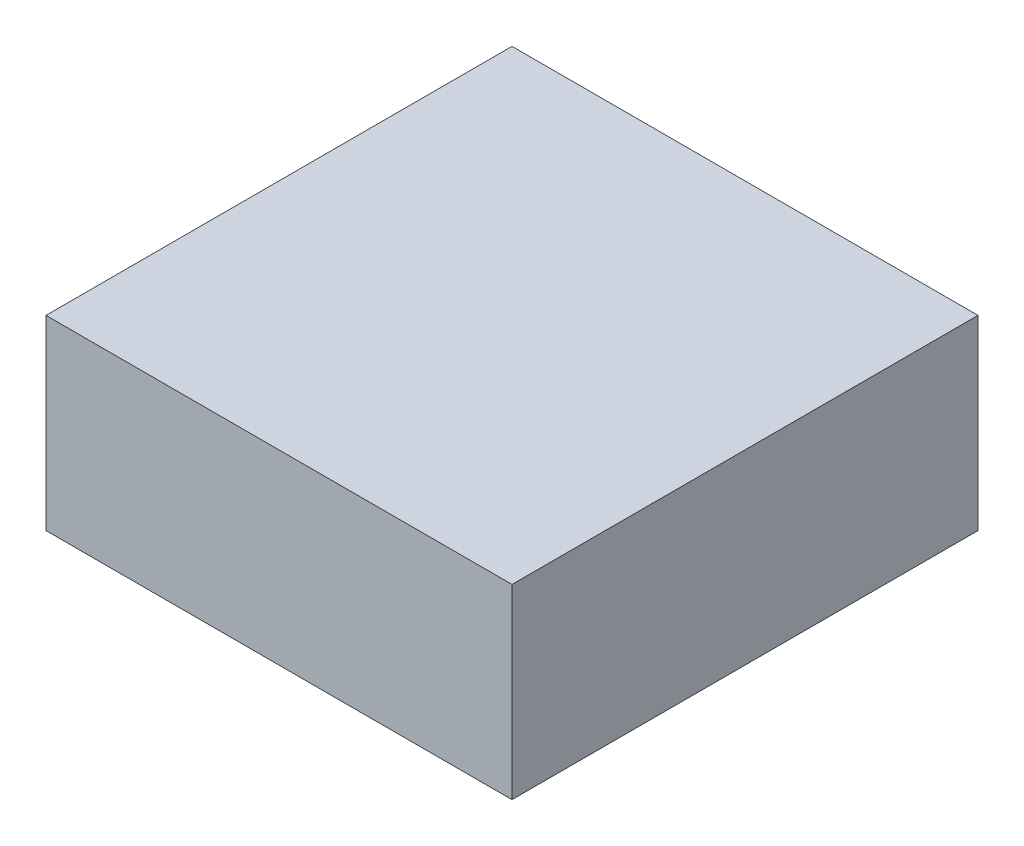
ISO-10303-21;
HEADER;
FILE_DESCRIPTION(('STEP AP214'),'2;1');
FILE_NAME('part.step','',(''),(''),'','','');
FILE_SCHEMA(('AUTOMOTIVE_DESIGN { 1 0 10303 214 1 1 1 1 }'));
ENDSEC;
DATA;
#1=APPLICATION_CONTEXT('core data for automotive mechanical design processes');
#2=APPLICATION_PROTOCOL_DEFINITION('international standard','automotive_design',2000,#1);
#3=PRODUCT_CONTEXT('',#1,'mechanical');
#4=PRODUCT('Part','Part','',(#3));
#5=PRODUCT_RELATED_PRODUCT_CATEGORY('part','',(#4));
#6=PRODUCT_DEFINITION_FORMATION('','',#4);
#7=PRODUCT_DEFINITION_CONTEXT('part definition',#1,'design');
#8=PRODUCT_DEFINITION('design','',#6,#7);
#9=PRODUCT_DEFINITION_SHAPE('','',#8);
#10=(LENGTH_UNIT() NAMED_UNIT(*) SI_UNIT(.MILLI.,.METRE.));
#11=(NAMED_UNIT(*) PLANE_ANGLE_UNIT() SI_UNIT($,.RADIAN.));
#12=(NAMED_UNIT(*) SI_UNIT($,.STERADIAN.) SOLID_ANGLE_UNIT());
#13=UNCERTAINTY_MEASURE_WITH_UNIT(LENGTH_MEASURE(1.E-05),#10,'distance_accuracy_value','');
#14=(GEOMETRIC_REPRESENTATION_CONTEXT(3) GLOBAL_UNCERTAINTY_ASSIGNED_CONTEXT((#13)) GLOBAL_UNIT_ASSIGNED_CONTEXT((#10,
#11,#12)) REPRESENTATION_CONTEXT('',''));
#15=CARTESIAN_POINT('',(0.,0.,0.));
#16=DIRECTION('',(0.,0.,1.));
#17=DIRECTION('',(1.,0.,0.));
#18=AXIS2_PLACEMENT_3D('',#15,#16,#17);
#19=CARTESIAN_POINT('',(-0.5,0.2,-0.5));
#20=DIRECTION('',(1.,0.,0.));
#21=DIRECTION('',(0.,0.,-1.));
#22=AXIS2_PLACEMENT_3D('',#19,#20,#21);
#23=PLANE('',#22);
#24=DIRECTION('',(0.,0.,1.));
#25=VECTOR('',#24,1.);
#26=CARTESIAN_POINT('',(-0.5,0.,-0.5));
#27=LINE('',#26,#25);
#28=CARTESIAN_POINT('',(-0.5,0.,-0.5));
#29=VERTEX_POINT('',#28);
#30=CARTESIAN_POINT('',(-0.5,0.,0.));
#31=VERTEX_POINT('',#30);
#32=EDGE_CURVE('E103',#29,#31,#27,.T.);
#33=ORIENTED_EDGE('',*,*,#32,.T.);
#34=DIRECTION('',(0.,-1.,0.));
#35=VECTOR('',#34,1.);
#36=CARTESIAN_POINT('',(-0.5,0.2,0.));
#37=LINE('',#36,#35);
#38=CARTESIAN_POINT('',(-0.5,0.2,0.));
#39=VERTEX_POINT('',#38);
#40=EDGE_CURVE('E11',#39,#31,#37,.T.);
#41=ORIENTED_EDGE('',*,*,#40,.F.);
#42=DIRECTION('',(0.,0.,1.));
#43=VECTOR('',#42,1.);
#44=CARTESIAN_POINT('',(-0.5,0.2,-0.5));
#45=LINE('',#44,#43);
#46=CARTESIAN_POINT('',(-0.5,0.2,-0.5));
#47=VERTEX_POINT('',#46);
#48=EDGE_CURVE('E91',#47,#39,#45,.T.);
#49=ORIENTED_EDGE('',*,*,#48,.F.);
#50=DIRECTION('',(0.,-1.,0.));
#51=VECTOR('',#50,1.);
#52=CARTESIAN_POINT('',(-0.5,0.2,-0.5));
#53=LINE('',#52,#51);
#54=EDGE_CURVE('E99',#47,#29,#53,.T.);
#55=ORIENTED_EDGE('',*,*,#54,.T.);
#56=EDGE_LOOP('',(#33,#41,#49,#55));
#57=FACE_BOUND('',#56,.T.);
#58=ADVANCED_FACE('F40',(#57),#23,.F.);
#59=CARTESIAN_POINT('',(-0.5,0.2,0.));
#60=DIRECTION('',(0.,0.,-1.));
#61=DIRECTION('',(-1.,0.,0.));
#62=AXIS2_PLACEMENT_3D('',#59,#60,#61);
#63=PLANE('',#62);
#64=DIRECTION('',(1.,0.,0.));
#65=VECTOR('',#64,1.);
#66=CARTESIAN_POINT('',(-0.5,0.,0.));
#67=LINE('',#66,#65);
#68=CARTESIAN_POINT('',(0.,0.,0.));
#69=VERTEX_POINT('',#68);
#70=EDGE_CURVE('E95',#31,#69,#67,.T.);
#71=ORIENTED_EDGE('',*,*,#70,.T.);
#72=DIRECTION('',(0.,-1.,0.));
#73=VECTOR('',#72,1.);
#74=CARTESIAN_POINT('',(0.,0.2,0.));
#75=LINE('',#74,#73);
#76=CARTESIAN_POINT('',(0.,0.2,0.));
#77=VERTEX_POINT('',#76);
#78=EDGE_CURVE('E48',#77,#69,#75,.T.);
#79=ORIENTED_EDGE('',*,*,#78,.F.);
#80=DIRECTION('',(1.,0.,0.));
#81=VECTOR('',#80,1.);
#82=CARTESIAN_POINT('',(-0.5,0.2,0.));
#83=LINE('',#82,#81);
#84=EDGE_CURVE('E86',#39,#77,#83,.T.);
#85=ORIENTED_EDGE('',*,*,#84,.F.);
#86=ORIENTED_EDGE('',*,*,#40,.T.);
#87=EDGE_LOOP('',(#71,#79,#85,#86));
#88=FACE_BOUND('',#87,.T.);
#89=ADVANCED_FACE('F94',(#88),#63,.F.);
#90=CARTESIAN_POINT('',(0.,0.2,-0.5));
#91=DIRECTION('',(-1.,0.,0.));
#92=DIRECTION('',(0.,0.,1.));
#93=AXIS2_PLACEMENT_3D('',#90,#91,#92);
#94=PLANE('',#93);
#95=DIRECTION('',(0.,0.,-1.));
#96=VECTOR('',#95,1.);
#97=CARTESIAN_POINT('',(0.,0.,-0.5));
#98=LINE('',#97,#96);
#99=CARTESIAN_POINT('',(0.,0.,-0.5));
#100=VERTEX_POINT('',#99);
#101=EDGE_CURVE('E73',#69,#100,#98,.T.);
#102=ORIENTED_EDGE('',*,*,#101,.T.);
#103=DIRECTION('',(0.,-1.,0.));
#104=VECTOR('',#103,1.);
#105=CARTESIAN_POINT('',(0.,0.2,-0.5));
#106=LINE('',#105,#104);
#107=CARTESIAN_POINT('',(0.,0.2,-0.5));
#108=VERTEX_POINT('',#107);
#109=EDGE_CURVE('E96',#108,#100,#106,.T.);
#110=ORIENTED_EDGE('',*,*,#109,.F.);
#111=DIRECTION('',(0.,0.,-1.));
#112=VECTOR('',#111,1.);
#113=CARTESIAN_POINT('',(0.,0.2,-0.5));
#114=LINE('',#113,#112);
#115=EDGE_CURVE('E89',#77,#108,#114,.T.);
#116=ORIENTED_EDGE('',*,*,#115,.F.);
#117=ORIENTED_EDGE('',*,*,#78,.T.);
#118=EDGE_LOOP('',(#102,#110,#116,#117));
#119=FACE_BOUND('',#118,.T.);
#120=ADVANCED_FACE('F97',(#119),#94,.F.);
#121=CARTESIAN_POINT('',(-0.5,0.2,-0.5));
#122=DIRECTION('',(0.,0.,1.));
#123=DIRECTION('',(1.,0.,0.));
#124=AXIS2_PLACEMENT_3D('',#121,#122,#123);
#125=PLANE('',#124);
#126=DIRECTION('',(-1.,0.,0.));
#127=VECTOR('',#126,1.);
#128=CARTESIAN_POINT('',(-0.5,0.,-0.5));
#129=LINE('',#128,#127);
#130=EDGE_CURVE('E79',#100,#29,#129,.T.);
#131=ORIENTED_EDGE('',*,*,#130,.T.);
#132=ORIENTED_EDGE('',*,*,#54,.F.);
#133=DIRECTION('',(-1.,0.,0.));
#134=VECTOR('',#133,1.);
#135=CARTESIAN_POINT('',(-0.5,0.2,-0.5));
#136=LINE('',#135,#134);
#137=EDGE_CURVE('E56',#108,#47,#136,.T.);
#138=ORIENTED_EDGE('',*,*,#137,.F.);
#139=ORIENTED_EDGE('',*,*,#109,.T.);
#140=EDGE_LOOP('',(#131,#132,#138,#139));
#141=FACE_BOUND('',#140,.T.);
#142=ADVANCED_FACE('F110',(#141),#125,.F.);
#143=CARTESIAN_POINT('',(0.,0.2,0.));
#144=DIRECTION('',(0.,1.,0.));
#145=DIRECTION('',(0.,0.,1.));
#146=AXIS2_PLACEMENT_3D('',#143,#144,#145);
#147=PLANE('',#146);
#148=ORIENTED_EDGE('',*,*,#48,.T.);
#149=ORIENTED_EDGE('',*,*,#84,.T.);
#150=ORIENTED_EDGE('',*,*,#115,.T.);
#151=ORIENTED_EDGE('',*,*,#137,.T.);
#152=EDGE_LOOP('',(#148,#149,#150,#151));
#153=FACE_BOUND('',#152,.T.);
#154=ADVANCED_FACE('F87',(#153),#147,.T.);
#155=CARTESIAN_POINT('',(0.,0.,0.));
#156=DIRECTION('',(0.,1.,0.));
#157=DIRECTION('',(0.,0.,1.));
#158=AXIS2_PLACEMENT_3D('',#155,#156,#157);
#159=PLANE('',#158);
#160=ORIENTED_EDGE('',*,*,#32,.F.);
#161=ORIENTED_EDGE('',*,*,#130,.F.);
#162=ORIENTED_EDGE('',*,*,#101,.F.);
#163=ORIENTED_EDGE('',*,*,#70,.F.);
#164=EDGE_LOOP('',(#160,#161,#162,#163));
#165=FACE_BOUND('',#164,.T.);
#166=ADVANCED_FACE('F113',(#165),#159,.F.);
#167=CLOSED_SHELL('',(#58,#89,#120,#142,#154,#166));
#168=MANIFOLD_SOLID_BREP('B2',#167);
#169=ADVANCED_BREP_SHAPE_REPRESENTATION('',(#18,#168),#14);
#170=SHAPE_DEFINITION_REPRESENTATION(#9,#169);
ENDSEC;
END-ISO-10303-21;
